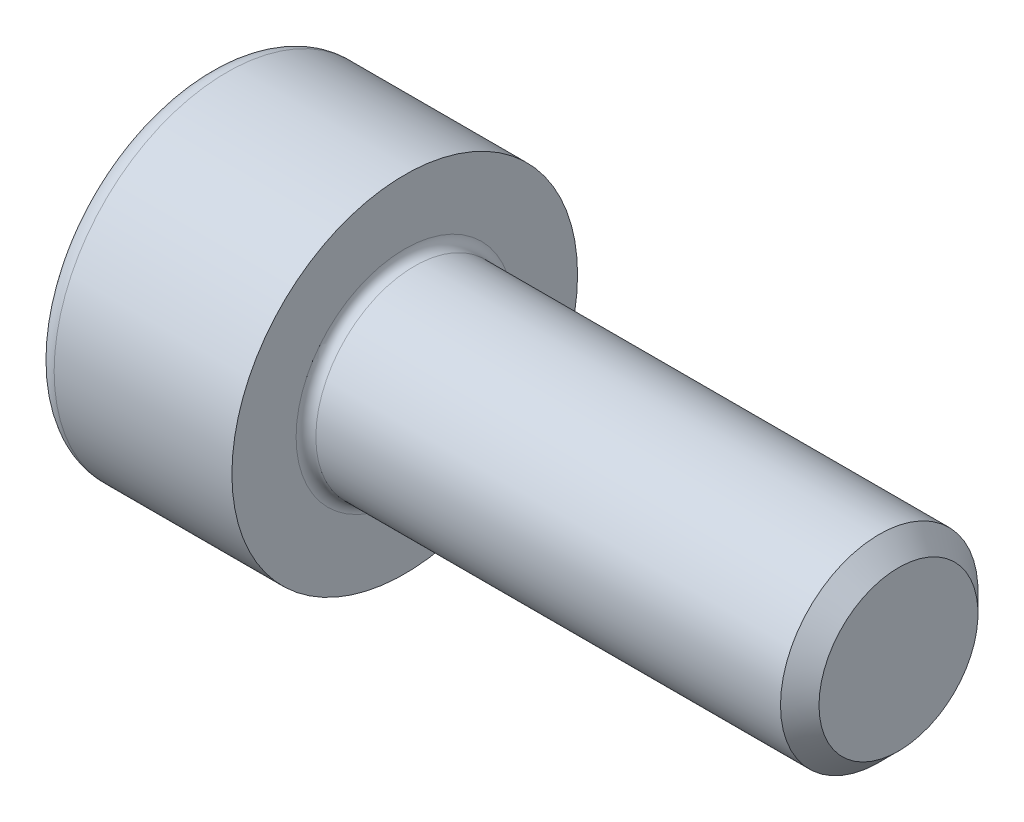
ISO-10303-21;
HEADER;
FILE_DESCRIPTION(('STEP AP214'),'2;1');
FILE_NAME('part.step','',(''),(''),'','','');
FILE_SCHEMA(('AUTOMOTIVE_DESIGN { 1 0 10303 214 1 1 1 1 }'));
ENDSEC;
DATA;
#1=APPLICATION_CONTEXT('core data for automotive mechanical design processes');
#2=APPLICATION_PROTOCOL_DEFINITION('international standard','automotive_design',2000,#1);
#3=PRODUCT_CONTEXT('',#1,'mechanical');
#4=PRODUCT('Part','Part','',(#3));
#5=PRODUCT_RELATED_PRODUCT_CATEGORY('part','',(#4));
#6=PRODUCT_DEFINITION_FORMATION('','',#4);
#7=PRODUCT_DEFINITION_CONTEXT('part definition',#1,'design');
#8=PRODUCT_DEFINITION('design','',#6,#7);
#9=PRODUCT_DEFINITION_SHAPE('','',#8);
#10=(LENGTH_UNIT() NAMED_UNIT(*) SI_UNIT(.MILLI.,.METRE.));
#11=(NAMED_UNIT(*) PLANE_ANGLE_UNIT() SI_UNIT($,.RADIAN.));
#12=(NAMED_UNIT(*) SI_UNIT($,.STERADIAN.) SOLID_ANGLE_UNIT());
#13=UNCERTAINTY_MEASURE_WITH_UNIT(LENGTH_MEASURE(1.E-05),#10,'distance_accuracy_value','');
#14=(GEOMETRIC_REPRESENTATION_CONTEXT(3) GLOBAL_UNCERTAINTY_ASSIGNED_CONTEXT((#13)) GLOBAL_UNIT_ASSIGNED_CONTEXT((#10,
#11,#12)) REPRESENTATION_CONTEXT('',''));
#15=CARTESIAN_POINT('',(0.,0.,0.));
#16=DIRECTION('',(0.,0.,1.));
#17=DIRECTION('',(1.,0.,0.));
#18=AXIS2_PLACEMENT_3D('',#15,#16,#17);
#19=CARTESIAN_POINT('',(0.,0.,0.));
#20=DIRECTION('',(-1.,0.,0.));
#21=DIRECTION('',(0.,0.,1.));
#22=AXIS2_PLACEMENT_3D('',#19,#20,#21);
#23=PLANE('',#22);
#24=DIRECTION('',(0.,-0.5,0.866025403784439));
#25=VECTOR('',#24,1.);
#26=CARTESIAN_POINT('',(0.,1.74359781295267,0.));
#27=LINE('',#26,#25);
#28=CARTESIAN_POINT('',(0.,1.74359781295267,0.));
#29=VERTEX_POINT('',#28);
#30=CARTESIAN_POINT('',(0.,0.87179890647633,1.51));
#31=VERTEX_POINT('',#30);
#32=EDGE_CURVE('E261',#29,#31,#27,.T.);
#33=ORIENTED_EDGE('',*,*,#32,.T.);
#34=DIRECTION('',(0.,1.,0.));
#35=VECTOR('',#34,1.);
#36=CARTESIAN_POINT('',(0.,-0.87179890647634,1.51));
#37=LINE('',#36,#35);
#38=CARTESIAN_POINT('',(0.,-0.87179890647634,1.51));
#39=VERTEX_POINT('',#38);
#40=EDGE_CURVE('E133',#39,#31,#37,.T.);
#41=ORIENTED_EDGE('',*,*,#40,.F.);
#42=DIRECTION('',(0.,-0.500000000000001,-0.866025403784438));
#43=VECTOR('',#42,1.);
#44=CARTESIAN_POINT('',(0.,-0.87179890647634,1.51));
#45=LINE('',#44,#43);
#46=CARTESIAN_POINT('',(0.,-1.74359781295268,0.));
#47=VERTEX_POINT('',#46);
#48=EDGE_CURVE('E264',#39,#47,#45,.T.);
#49=ORIENTED_EDGE('',*,*,#48,.T.);
#50=DIRECTION('',(0.,0.5,-0.866025403784439));
#51=VECTOR('',#50,1.);
#52=CARTESIAN_POINT('',(0.,-1.74359781295268,0.));
#53=LINE('',#52,#51);
#54=CARTESIAN_POINT('',(0.,-0.871798906476343,-1.51));
#55=VERTEX_POINT('',#54);
#56=EDGE_CURVE('E267',#47,#55,#53,.T.);
#57=ORIENTED_EDGE('',*,*,#56,.T.);
#58=DIRECTION('',(0.,-1.,0.));
#59=VECTOR('',#58,1.);
#60=CARTESIAN_POINT('',(0.,0.871798906476328,-1.51));
#61=LINE('',#60,#59);
#62=CARTESIAN_POINT('',(0.,0.871798906476328,-1.51));
#63=VERTEX_POINT('',#62);
#64=EDGE_CURVE('E270',#63,#55,#61,.T.);
#65=ORIENTED_EDGE('',*,*,#64,.F.);
#66=DIRECTION('',(0.,-0.500000000000001,-0.866025403784438));
#67=VECTOR('',#66,1.);
#68=CARTESIAN_POINT('',(0.,1.74359781295267,0.));
#69=LINE('',#68,#67);
#70=EDGE_CURVE('E128',#29,#63,#69,.T.);
#71=ORIENTED_EDGE('',*,*,#70,.F.);
#72=EDGE_LOOP('',(#33,#41,#49,#57,#65,#71));
#73=FACE_BOUND('',#72,.T.);
#74=CARTESIAN_POINT('',(0.,0.,0.));
#75=DIRECTION('',(-1.,0.,0.));
#76=DIRECTION('',(0.,0.,1.));
#77=AXIS2_PLACEMENT_3D('',#74,#75,#76);
#78=CIRCLE('',#77,3.1);
#79=CARTESIAN_POINT('',(0.,0.,3.1));
#80=VERTEX_POINT('',#79);
#81=EDGE_CURVE('E45',#80,#80,#78,.T.);
#82=ORIENTED_EDGE('',*,*,#81,.T.);
#83=EDGE_LOOP('',(#82));
#84=FACE_BOUND('',#83,.T.);
#85=ADVANCED_FACE('F37',(#73,#84),#23,.T.);
#86=CARTESIAN_POINT('',(-31.75,0.,0.));
#87=DIRECTION('',(-1.,0.,0.));
#88=DIRECTION('',(0.,0.,1.));
#89=AXIS2_PLACEMENT_3D('',#86,#87,#88);
#90=CYLINDRICAL_SURFACE('',#89,3.5);
#91=CARTESIAN_POINT('',(0.399999999999998,0.,0.));
#92=DIRECTION('',(-1.,0.,0.));
#93=DIRECTION('',(0.,0.,1.));
#94=AXIS2_PLACEMENT_3D('',#91,#92,#93);
#95=CIRCLE('',#94,3.5);
#96=CARTESIAN_POINT('',(0.399999999999998,0.,3.5));
#97=VERTEX_POINT('',#96);
#98=EDGE_CURVE('E11',#97,#97,#95,.F.);
#99=ORIENTED_EDGE('',*,*,#98,.T.);
#100=EDGE_LOOP('',(#99));
#101=FACE_BOUND('',#100,.T.);
#102=CARTESIAN_POINT('',(4.,0.,0.));
#103=DIRECTION('',(-1.,0.,0.));
#104=DIRECTION('',(0.,0.,1.));
#105=AXIS2_PLACEMENT_3D('',#102,#103,#104);
#106=CIRCLE('',#105,3.5);
#107=CARTESIAN_POINT('',(4.,0.,3.5));
#108=VERTEX_POINT('',#107);
#109=EDGE_CURVE('E151',#108,#108,#106,.T.);
#110=ORIENTED_EDGE('',*,*,#109,.T.);
#111=EDGE_LOOP('',(#110));
#112=FACE_BOUND('',#111,.T.);
#113=ADVANCED_FACE('F175',(#101,#112),#90,.T.);
#114=CARTESIAN_POINT('',(4.,3.5,0.));
#115=DIRECTION('',(1.,0.,0.));
#116=DIRECTION('',(0.,0.,-1.));
#117=AXIS2_PLACEMENT_3D('',#114,#115,#116);
#118=PLANE('',#117);
#119=CARTESIAN_POINT('',(4.,0.,0.));
#120=DIRECTION('',(1.,0.,0.));
#121=DIRECTION('',(0.,0.,-1.));
#122=AXIS2_PLACEMENT_3D('',#119,#120,#121);
#123=CIRCLE('',#122,2.2);
#124=CARTESIAN_POINT('',(4.,0.,-2.2));
#125=VERTEX_POINT('',#124);
#126=EDGE_CURVE('E154',#125,#125,#123,.F.);
#127=ORIENTED_EDGE('',*,*,#126,.T.);
#128=EDGE_LOOP('',(#127));
#129=FACE_BOUND('',#128,.T.);
#130=ORIENTED_EDGE('',*,*,#109,.F.);
#131=EDGE_LOOP('',(#130));
#132=FACE_BOUND('',#131,.T.);
#133=ADVANCED_FACE('F181',(#129,#132),#118,.T.);
#134=CARTESIAN_POINT('',(-31.75,0.,0.));
#135=DIRECTION('',(-1.,0.,0.));
#136=DIRECTION('',(0.,0.,1.));
#137=AXIS2_PLACEMENT_3D('',#134,#135,#136);
#138=CYLINDRICAL_SURFACE('',#137,2.);
#139=CARTESIAN_POINT('',(4.2,0.,0.));
#140=DIRECTION('',(1.,0.,0.));
#141=DIRECTION('',(0.,0.,-1.));
#142=AXIS2_PLACEMENT_3D('',#139,#140,#141);
#143=CIRCLE('',#142,2.);
#144=CARTESIAN_POINT('',(4.2,0.,-2.));
#145=VERTEX_POINT('',#144);
#146=EDGE_CURVE('E157',#145,#145,#143,.T.);
#147=ORIENTED_EDGE('',*,*,#146,.T.);
#148=EDGE_LOOP('',(#147));
#149=FACE_BOUND('',#148,.T.);
#150=CARTESIAN_POINT('',(13.61,0.,0.));
#151=DIRECTION('',(-1.,0.,0.));
#152=DIRECTION('',(0.,0.,1.));
#153=AXIS2_PLACEMENT_3D('',#150,#151,#152);
#154=CIRCLE('',#153,1.99999999999999);
#155=CARTESIAN_POINT('',(13.61,0.,1.99999999999999));
#156=VERTEX_POINT('',#155);
#157=EDGE_CURVE('E148',#156,#156,#154,.T.);
#158=ORIENTED_EDGE('',*,*,#157,.T.);
#159=EDGE_LOOP('',(#158));
#160=FACE_BOUND('',#159,.T.);
#161=ADVANCED_FACE('F187',(#149,#160),#138,.T.);
#162=CARTESIAN_POINT('',(14.,0.,0.));
#163=DIRECTION('',(-1.,0.,0.));
#164=DIRECTION('',(0.,0.,1.));
#165=AXIS2_PLACEMENT_3D('',#162,#163,#164);
#166=CONICAL_SURFACE('',#165,1.61,0.785398163397438);
#167=ORIENTED_EDGE('',*,*,#157,.F.);
#168=EDGE_LOOP('',(#167));
#169=FACE_BOUND('',#168,.T.);
#170=CARTESIAN_POINT('',(14.,0.,0.));
#171=DIRECTION('',(-1.,0.,0.));
#172=DIRECTION('',(0.,0.,1.));
#173=AXIS2_PLACEMENT_3D('',#170,#171,#172);
#174=CIRCLE('',#173,1.61);
#175=CARTESIAN_POINT('',(14.,0.,1.61));
#176=VERTEX_POINT('',#175);
#177=EDGE_CURVE('E144',#176,#176,#174,.T.);
#178=ORIENTED_EDGE('',*,*,#177,.T.);
#179=EDGE_LOOP('',(#178));
#180=FACE_BOUND('',#179,.T.);
#181=ADVANCED_FACE('F191',(#169,#180),#166,.T.);
#182=CARTESIAN_POINT('',(14.,1.61,0.));
#183=DIRECTION('',(1.,0.,0.));
#184=DIRECTION('',(0.,0.,-1.));
#185=AXIS2_PLACEMENT_3D('',#182,#183,#184);
#186=PLANE('',#185);
#187=ORIENTED_EDGE('',*,*,#177,.F.);
#188=EDGE_LOOP('',(#187));
#189=FACE_BOUND('',#188,.T.);
#190=ADVANCED_FACE('F171',(#189),#186,.T.);
#191=CARTESIAN_POINT('',(4.2,0.,0.));
#192=DIRECTION('',(1.,0.,0.));
#193=DIRECTION('',(0.,0.,-1.));
#194=AXIS2_PLACEMENT_3D('',#191,#192,#193);
#195=TOROIDAL_SURFACE('',#194,2.2,0.2);
#196=ORIENTED_EDGE('',*,*,#146,.F.);
#197=EDGE_LOOP('',(#196));
#198=FACE_BOUND('',#197,.T.);
#199=ORIENTED_EDGE('',*,*,#126,.F.);
#200=EDGE_LOOP('',(#199));
#201=FACE_BOUND('',#200,.T.);
#202=ADVANCED_FACE('F164',(#198,#201),#195,.F.);
#203=CARTESIAN_POINT('',(0.399999999999998,0.,0.));
#204=DIRECTION('',(-1.,0.,0.));
#205=DIRECTION('',(0.,0.,1.));
#206=AXIS2_PLACEMENT_3D('',#203,#204,#205);
#207=TOROIDAL_SURFACE('',#206,3.1,0.4);
#208=ORIENTED_EDGE('',*,*,#98,.F.);
#209=EDGE_LOOP('',(#208));
#210=FACE_BOUND('',#209,.T.);
#211=ORIENTED_EDGE('',*,*,#81,.F.);
#212=EDGE_LOOP('',(#211));
#213=FACE_BOUND('',#212,.T.);
#214=ADVANCED_FACE('F39',(#210,#213),#207,.T.);
#215=CARTESIAN_POINT('',(2.,1.74359781295267,0.));
#216=DIRECTION('',(0.,-0.866025403784439,-0.5));
#217=DIRECTION('',(0.,0.5,-0.866025403784439));
#218=AXIS2_PLACEMENT_3D('',#215,#216,#217);
#219=PLANE('',#218);
#220=ORIENTED_EDGE('',*,*,#32,.F.);
#221=DIRECTION('',(-1.,0.,0.));
#222=VECTOR('',#221,1.);
#223=CARTESIAN_POINT('',(2.,1.74359781295267,0.));
#224=LINE('',#223,#222);
#225=CARTESIAN_POINT('',(2.,1.74359781295267,0.));
#226=VERTEX_POINT('',#225);
#227=EDGE_CURVE('E251',#226,#29,#224,.T.);
#228=ORIENTED_EDGE('',*,*,#227,.F.);
#229=DIRECTION('',(0.,-0.5,0.866025403784439));
#230=VECTOR('',#229,1.);
#231=CARTESIAN_POINT('',(2.,1.74359781295267,0.));
#232=LINE('',#231,#230);
#233=CARTESIAN_POINT('',(2.,1.3076983597145,0.754999999999997));
#234=VERTEX_POINT('',#233);
#235=EDGE_CURVE('E120',#226,#234,#232,.T.);
#236=ORIENTED_EDGE('',*,*,#235,.T.);
#237=CARTESIAN_POINT('',(2.,0.87179890647633,1.51));
#238=VERTEX_POINT('',#237);
#239=EDGE_CURVE('E111',#234,#238,#232,.T.);
#240=ORIENTED_EDGE('',*,*,#239,.T.);
#241=DIRECTION('',(-1.,0.,0.));
#242=VECTOR('',#241,1.);
#243=CARTESIAN_POINT('',(2.,0.87179890647633,1.51));
#244=LINE('',#243,#242);
#245=EDGE_CURVE('E125',#238,#31,#244,.T.);
#246=ORIENTED_EDGE('',*,*,#245,.T.);
#247=EDGE_LOOP('',(#220,#228,#236,#240,#246));
#248=FACE_BOUND('',#247,.T.);
#249=ADVANCED_FACE('F124',(#248),#219,.T.);
#250=CARTESIAN_POINT('',(2.,-0.87179890647634,1.51));
#251=DIRECTION('',(0.,0.,1.));
#252=DIRECTION('',(0.,-1.,0.));
#253=AXIS2_PLACEMENT_3D('',#250,#251,#252);
#254=PLANE('',#253);
#255=ORIENTED_EDGE('',*,*,#40,.T.);
#256=ORIENTED_EDGE('',*,*,#245,.F.);
#257=DIRECTION('',(0.,1.,0.));
#258=VECTOR('',#257,1.);
#259=CARTESIAN_POINT('',(2.,-0.87179890647634,1.51));
#260=LINE('',#259,#258);
#261=CARTESIAN_POINT('',(2.,0.,1.51));
#262=VERTEX_POINT('',#261);
#263=EDGE_CURVE('E108',#262,#238,#260,.T.);
#264=ORIENTED_EDGE('',*,*,#263,.F.);
#265=CARTESIAN_POINT('',(2.,-0.87179890647634,1.51));
#266=VERTEX_POINT('',#265);
#267=EDGE_CURVE('E119',#266,#262,#260,.T.);
#268=ORIENTED_EDGE('',*,*,#267,.F.);
#269=DIRECTION('',(-1.,0.,0.));
#270=VECTOR('',#269,1.);
#271=CARTESIAN_POINT('',(2.,-0.87179890647634,1.51));
#272=LINE('',#271,#270);
#273=EDGE_CURVE('E135',#266,#39,#272,.T.);
#274=ORIENTED_EDGE('',*,*,#273,.T.);
#275=EDGE_LOOP('',(#255,#256,#264,#268,#274));
#276=FACE_BOUND('',#275,.T.);
#277=ADVANCED_FACE('F130',(#276),#254,.F.);
#278=CARTESIAN_POINT('',(2.,-0.87179890647634,1.51));
#279=DIRECTION('',(0.,0.866025403784438,-0.500000000000001));
#280=DIRECTION('',(0.,0.500000000000001,0.866025403784438));
#281=AXIS2_PLACEMENT_3D('',#278,#279,#280);
#282=PLANE('',#281);
#283=ORIENTED_EDGE('',*,*,#48,.F.);
#284=ORIENTED_EDGE('',*,*,#273,.F.);
#285=DIRECTION('',(0.,-0.500000000000001,-0.866025403784438));
#286=VECTOR('',#285,1.);
#287=CARTESIAN_POINT('',(2.,-0.87179890647634,1.51));
#288=LINE('',#287,#286);
#289=CARTESIAN_POINT('',(2.,-1.30769835971451,0.755000000000004));
#290=VERTEX_POINT('',#289);
#291=EDGE_CURVE('E290',#266,#290,#288,.T.);
#292=ORIENTED_EDGE('',*,*,#291,.T.);
#293=CARTESIAN_POINT('',(2.,-1.74359781295268,0.));
#294=VERTEX_POINT('',#293);
#295=EDGE_CURVE('E279',#290,#294,#288,.T.);
#296=ORIENTED_EDGE('',*,*,#295,.T.);
#297=DIRECTION('',(-1.,0.,0.));
#298=VECTOR('',#297,1.);
#299=CARTESIAN_POINT('',(2.,-1.74359781295268,0.));
#300=LINE('',#299,#298);
#301=EDGE_CURVE('E140',#294,#47,#300,.T.);
#302=ORIENTED_EDGE('',*,*,#301,.T.);
#303=EDGE_LOOP('',(#283,#284,#292,#296,#302));
#304=FACE_BOUND('',#303,.T.);
#305=ADVANCED_FACE('F205',(#304),#282,.T.);
#306=CARTESIAN_POINT('',(2.,-1.74359781295268,0.));
#307=DIRECTION('',(0.,0.866025403784439,0.5));
#308=DIRECTION('',(0.,-0.5,0.866025403784439));
#309=AXIS2_PLACEMENT_3D('',#306,#307,#308);
#310=PLANE('',#309);
#311=ORIENTED_EDGE('',*,*,#56,.F.);
#312=ORIENTED_EDGE('',*,*,#301,.F.);
#313=DIRECTION('',(0.,0.5,-0.866025403784439));
#314=VECTOR('',#313,1.);
#315=CARTESIAN_POINT('',(2.,-1.74359781295268,0.));
#316=LINE('',#315,#314);
#317=CARTESIAN_POINT('',(2.,-1.30769835971451,-0.755000000000002));
#318=VERTEX_POINT('',#317);
#319=EDGE_CURVE('E257',#294,#318,#316,.T.);
#320=ORIENTED_EDGE('',*,*,#319,.T.);
#321=CARTESIAN_POINT('',(2.,-0.871798906476343,-1.51));
#322=VERTEX_POINT('',#321);
#323=EDGE_CURVE('E289',#318,#322,#316,.T.);
#324=ORIENTED_EDGE('',*,*,#323,.T.);
#325=DIRECTION('',(-1.,0.,0.));
#326=VECTOR('',#325,1.);
#327=CARTESIAN_POINT('',(2.,-0.871798906476343,-1.51));
#328=LINE('',#327,#326);
#329=EDGE_CURVE('E250',#322,#55,#328,.T.);
#330=ORIENTED_EDGE('',*,*,#329,.T.);
#331=EDGE_LOOP('',(#311,#312,#320,#324,#330));
#332=FACE_BOUND('',#331,.T.);
#333=ADVANCED_FACE('F208',(#332),#310,.T.);
#334=CARTESIAN_POINT('',(2.,0.871798906476328,-1.51));
#335=DIRECTION('',(0.,0.,-1.));
#336=DIRECTION('',(0.,1.,0.));
#337=AXIS2_PLACEMENT_3D('',#334,#335,#336);
#338=PLANE('',#337);
#339=ORIENTED_EDGE('',*,*,#64,.T.);
#340=ORIENTED_EDGE('',*,*,#329,.F.);
#341=DIRECTION('',(0.,-1.,0.));
#342=VECTOR('',#341,1.);
#343=CARTESIAN_POINT('',(2.,0.871798906476328,-1.51));
#344=LINE('',#343,#342);
#345=CARTESIAN_POINT('',(2.,0.,-1.51));
#346=VERTEX_POINT('',#345);
#347=EDGE_CURVE('E254',#346,#322,#344,.T.);
#348=ORIENTED_EDGE('',*,*,#347,.F.);
#349=CARTESIAN_POINT('',(2.,0.871798906476328,-1.51));
#350=VERTEX_POINT('',#349);
#351=EDGE_CURVE('E52',#350,#346,#344,.T.);
#352=ORIENTED_EDGE('',*,*,#351,.F.);
#353=DIRECTION('',(-1.,0.,0.));
#354=VECTOR('',#353,1.);
#355=CARTESIAN_POINT('',(2.,0.871798906476328,-1.51));
#356=LINE('',#355,#354);
#357=EDGE_CURVE('E247',#350,#63,#356,.T.);
#358=ORIENTED_EDGE('',*,*,#357,.T.);
#359=EDGE_LOOP('',(#339,#340,#348,#352,#358));
#360=FACE_BOUND('',#359,.T.);
#361=ADVANCED_FACE('F212',(#360),#338,.F.);
#362=CARTESIAN_POINT('',(2.,1.74359781295267,0.));
#363=DIRECTION('',(0.,0.866025403784438,-0.500000000000001));
#364=DIRECTION('',(0.,0.500000000000001,0.866025403784438));
#365=AXIS2_PLACEMENT_3D('',#362,#363,#364);
#366=PLANE('',#365);
#367=ORIENTED_EDGE('',*,*,#70,.T.);
#368=ORIENTED_EDGE('',*,*,#357,.F.);
#369=DIRECTION('',(0.,-0.500000000000001,-0.866025403784438));
#370=VECTOR('',#369,1.);
#371=CARTESIAN_POINT('',(2.,1.74359781295267,0.));
#372=LINE('',#371,#370);
#373=CARTESIAN_POINT('',(2.,1.3076983597145,-0.755));
#374=VERTEX_POINT('',#373);
#375=EDGE_CURVE('E237',#374,#350,#372,.T.);
#376=ORIENTED_EDGE('',*,*,#375,.F.);
#377=EDGE_CURVE('E243',#226,#374,#372,.T.);
#378=ORIENTED_EDGE('',*,*,#377,.F.);
#379=ORIENTED_EDGE('',*,*,#227,.T.);
#380=EDGE_LOOP('',(#367,#368,#376,#378,#379));
#381=FACE_BOUND('',#380,.T.);
#382=ADVANCED_FACE('F216',(#381),#366,.F.);
#383=CARTESIAN_POINT('',(2.,1.74359781295267,0.));
#384=DIRECTION('',(1.,0.,0.));
#385=DIRECTION('',(0.,0.,-1.));
#386=AXIS2_PLACEMENT_3D('',#383,#384,#385);
#387=PLANE('',#386);
#388=ORIENTED_EDGE('',*,*,#347,.T.);
#389=ORIENTED_EDGE('',*,*,#323,.F.);
#390=CARTESIAN_POINT('',(2.,0.,0.));
#391=DIRECTION('',(-1.,0.,0.));
#392=DIRECTION('',(0.,0.,1.));
#393=AXIS2_PLACEMENT_3D('',#390,#391,#392);
#394=CIRCLE('',#393,1.51);
#395=EDGE_CURVE('E285',#346,#318,#394,.T.);
#396=ORIENTED_EDGE('',*,*,#395,.F.);
#397=EDGE_LOOP('',(#388,#389,#396));
#398=FACE_BOUND('',#397,.T.);
#399=ADVANCED_FACE('F220',(#398),#387,.F.);
#400=ORIENTED_EDGE('',*,*,#319,.F.);
#401=ORIENTED_EDGE('',*,*,#295,.F.);
#402=EDGE_CURVE('E138',#318,#290,#394,.T.);
#403=ORIENTED_EDGE('',*,*,#402,.F.);
#404=EDGE_LOOP('',(#400,#401,#403));
#405=FACE_BOUND('',#404,.T.);
#406=ADVANCED_FACE('F223',(#405),#387,.F.);
#407=ORIENTED_EDGE('',*,*,#291,.F.);
#408=ORIENTED_EDGE('',*,*,#267,.T.);
#409=EDGE_CURVE('E134',#290,#262,#394,.T.);
#410=ORIENTED_EDGE('',*,*,#409,.F.);
#411=EDGE_LOOP('',(#407,#408,#410));
#412=FACE_BOUND('',#411,.T.);
#413=ADVANCED_FACE('F228',(#412),#387,.F.);
#414=ORIENTED_EDGE('',*,*,#263,.T.);
#415=ORIENTED_EDGE('',*,*,#239,.F.);
#416=EDGE_CURVE('E114',#262,#234,#394,.T.);
#417=ORIENTED_EDGE('',*,*,#416,.F.);
#418=EDGE_LOOP('',(#414,#415,#417));
#419=FACE_BOUND('',#418,.T.);
#420=ADVANCED_FACE('F110',(#419),#387,.F.);
#421=ORIENTED_EDGE('',*,*,#235,.F.);
#422=ORIENTED_EDGE('',*,*,#377,.T.);
#423=EDGE_CURVE('E145',#234,#374,#394,.T.);
#424=ORIENTED_EDGE('',*,*,#423,.F.);
#425=EDGE_LOOP('',(#421,#422,#424));
#426=FACE_BOUND('',#425,.T.);
#427=ADVANCED_FACE('F231',(#426),#387,.F.);
#428=ORIENTED_EDGE('',*,*,#375,.T.);
#429=ORIENTED_EDGE('',*,*,#351,.T.);
#430=EDGE_CURVE('E240',#374,#346,#394,.T.);
#431=ORIENTED_EDGE('',*,*,#430,.F.);
#432=EDGE_LOOP('',(#428,#429,#431));
#433=FACE_BOUND('',#432,.T.);
#434=ADVANCED_FACE('F201',(#433),#387,.F.);
#435=CARTESIAN_POINT('',(2.,0.,0.));
#436=DIRECTION('',(-1.,0.,0.));
#437=DIRECTION('',(0.,0.,1.));
#438=AXIS2_PLACEMENT_3D('',#435,#436,#437);
#439=CONICAL_SURFACE('',#438,1.51,1.04719755119659);
#440=CARTESIAN_POINT('',(2.87179890647635,0.,0.));
#441=VERTEX_POINT('',#440);
#442=VERTEX_LOOP('',#441);
#443=FACE_BOUND('',#442,.T.);
#444=ORIENTED_EDGE('',*,*,#416,.T.);
#445=ORIENTED_EDGE('',*,*,#423,.T.);
#446=ORIENTED_EDGE('',*,*,#430,.T.);
#447=ORIENTED_EDGE('',*,*,#395,.T.);
#448=ORIENTED_EDGE('',*,*,#402,.T.);
#449=ORIENTED_EDGE('',*,*,#409,.T.);
#450=EDGE_LOOP('',(#444,#445,#446,#447,#448,#449));
#451=FACE_BOUND('',#450,.T.);
#452=ADVANCED_FACE('F199',(#443,#451),#439,.F.);
#453=CLOSED_SHELL('',(#85,#113,#133,#161,#181,#190,#202,#214,#249,#277,#305,#333,#361,#382,#399,
#406,#413,#420,#427,#434,#452));
#454=MANIFOLD_SOLID_BREP('B2',#453);
#455=ADVANCED_BREP_SHAPE_REPRESENTATION('',(#18,#454),#14);
#456=SHAPE_DEFINITION_REPRESENTATION(#9,#455);
ENDSEC;
END-ISO-10303-21;
